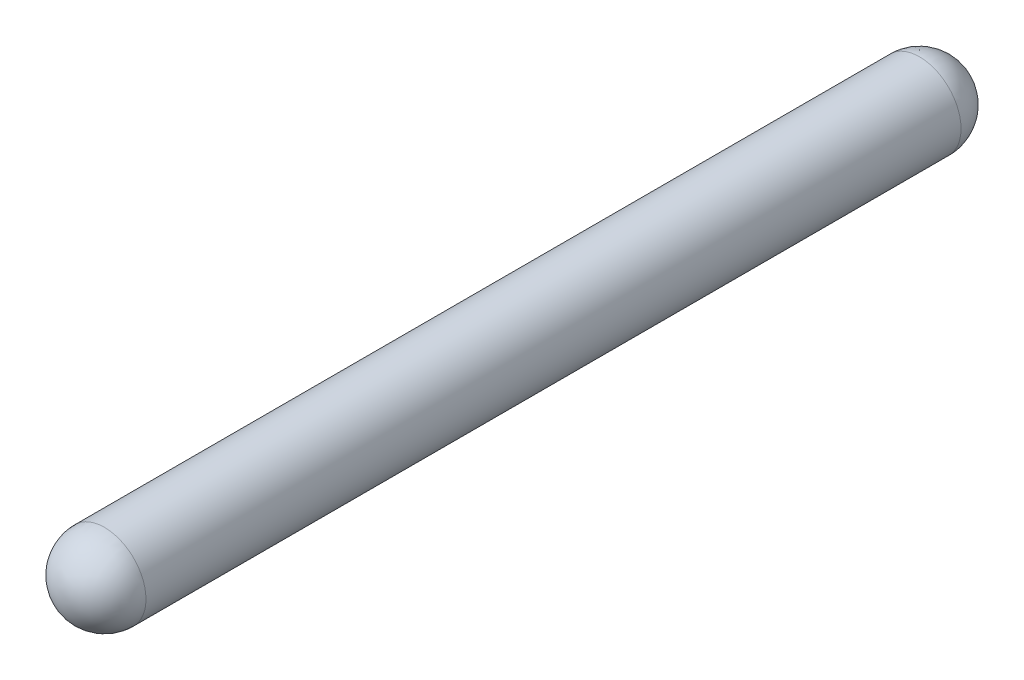
ISO-10303-21;
HEADER;
FILE_DESCRIPTION(('STEP AP214'),'2;1');
FILE_NAME('part.step','',(''),(''),'','','');
FILE_SCHEMA(('AUTOMOTIVE_DESIGN { 1 0 10303 214 1 1 1 1 }'));
ENDSEC;
DATA;
#1=APPLICATION_CONTEXT('core data for automotive mechanical design processes');
#2=APPLICATION_PROTOCOL_DEFINITION('international standard','automotive_design',2000,#1);
#3=PRODUCT_CONTEXT('',#1,'mechanical');
#4=PRODUCT('Part','Part','',(#3));
#5=PRODUCT_RELATED_PRODUCT_CATEGORY('part','',(#4));
#6=PRODUCT_DEFINITION_FORMATION('','',#4);
#7=PRODUCT_DEFINITION_CONTEXT('part definition',#1,'design');
#8=PRODUCT_DEFINITION('design','',#6,#7);
#9=PRODUCT_DEFINITION_SHAPE('','',#8);
#10=(LENGTH_UNIT() NAMED_UNIT(*) SI_UNIT(.MILLI.,.METRE.));
#11=(NAMED_UNIT(*) PLANE_ANGLE_UNIT() SI_UNIT($,.RADIAN.));
#12=(NAMED_UNIT(*) SI_UNIT($,.STERADIAN.) SOLID_ANGLE_UNIT());
#13=UNCERTAINTY_MEASURE_WITH_UNIT(LENGTH_MEASURE(1.E-05),#10,'distance_accuracy_value','');
#14=(GEOMETRIC_REPRESENTATION_CONTEXT(3) GLOBAL_UNCERTAINTY_ASSIGNED_CONTEXT((#13)) GLOBAL_UNIT_ASSIGNED_CONTEXT((#10,
#11,#12)) REPRESENTATION_CONTEXT('',''));
#15=CARTESIAN_POINT('',(0.,0.,0.));
#16=DIRECTION('',(0.,0.,1.));
#17=DIRECTION('',(1.,0.,0.));
#18=AXIS2_PLACEMENT_3D('',#15,#16,#17);
#19=CARTESIAN_POINT('',(0.,0.,-3.));
#20=DIRECTION('',(1.,0.,0.));
#21=DIRECTION('',(0.,-1.,0.));
#22=AXIS2_PLACEMENT_3D('',#19,#20,#21);
#23=SPHERICAL_SURFACE('',#22,0.331);
#24=CARTESIAN_POINT('',(0.,0.,-3.));
#25=DIRECTION('',(0.,0.,1.));
#26=DIRECTION('',(1.,0.,0.));
#27=AXIS2_PLACEMENT_3D('',#24,#25,#26);
#28=CIRCLE('',#27,0.331);
#29=CARTESIAN_POINT('',(0.331,0.,-3.));
#30=VERTEX_POINT('',#29);
#31=CARTESIAN_POINT('',(-0.331,0.,-3.));
#32=VERTEX_POINT('',#31);
#33=EDGE_CURVE('E42',#30,#32,#28,.T.);
#34=ORIENTED_EDGE('',*,*,#33,.F.);
#35=CARTESIAN_POINT('',(0.,0.,-3.));
#36=DIRECTION('',(0.,0.,1.));
#37=DIRECTION('',(1.,0.,0.));
#38=AXIS2_PLACEMENT_3D('',#35,#36,#37);
#39=CIRCLE('',#38,0.331);
#40=EDGE_CURVE('E26',#32,#30,#39,.T.);
#41=ORIENTED_EDGE('',*,*,#40,.F.);
#42=EDGE_LOOP('',(#34,#41));
#43=FACE_BOUND('',#42,.T.);
#44=ADVANCED_FACE('F17',(#43),#23,.T.);
#45=CARTESIAN_POINT('',(0.,0.,3.5));
#46=DIRECTION('',(1.,0.,0.));
#47=DIRECTION('',(0.,1.,0.));
#48=AXIS2_PLACEMENT_3D('',#45,#46,#47);
#49=SPHERICAL_SURFACE('',#48,0.331);
#50=CARTESIAN_POINT('',(0.,0.,3.5));
#51=DIRECTION('',(0.,0.,1.));
#52=DIRECTION('',(1.,0.,0.));
#53=AXIS2_PLACEMENT_3D('',#50,#51,#52);
#54=CIRCLE('',#53,0.331);
#55=CARTESIAN_POINT('',(0.331,0.,3.5));
#56=VERTEX_POINT('',#55);
#57=CARTESIAN_POINT('',(-0.331,0.,3.5));
#58=VERTEX_POINT('',#57);
#59=EDGE_CURVE('E11',#56,#58,#54,.F.);
#60=ORIENTED_EDGE('',*,*,#59,.F.);
#61=CARTESIAN_POINT('',(0.,0.,3.5));
#62=DIRECTION('',(0.,0.,1.));
#63=DIRECTION('',(1.,0.,0.));
#64=AXIS2_PLACEMENT_3D('',#61,#62,#63);
#65=CIRCLE('',#64,0.331);
#66=EDGE_CURVE('E34',#58,#56,#65,.F.);
#67=ORIENTED_EDGE('',*,*,#66,.F.);
#68=EDGE_LOOP('',(#60,#67));
#69=FACE_BOUND('',#68,.T.);
#70=ADVANCED_FACE('F49',(#69),#49,.T.);
#71=CARTESIAN_POINT('',(0.,0.,-3.));
#72=DIRECTION('',(0.,0.,1.));
#73=DIRECTION('',(1.,0.,0.));
#74=AXIS2_PLACEMENT_3D('',#71,#72,#73);
#75=CYLINDRICAL_SURFACE('',#74,0.331);
#76=ORIENTED_EDGE('',*,*,#66,.T.);
#77=ORIENTED_EDGE('',*,*,#59,.T.);
#78=EDGE_LOOP('',(#76,#77));
#79=FACE_BOUND('',#78,.T.);
#80=ORIENTED_EDGE('',*,*,#40,.T.);
#81=ORIENTED_EDGE('',*,*,#33,.T.);
#82=EDGE_LOOP('',(#80,#81));
#83=FACE_BOUND('',#82,.T.);
#84=ADVANCED_FACE('F45',(#79,#83),#75,.T.);
#85=CLOSED_SHELL('',(#44,#70,#84));
#86=MANIFOLD_SOLID_BREP('B1',#85);
#87=ADVANCED_BREP_SHAPE_REPRESENTATION('',(#18,#86),#14);
#88=SHAPE_DEFINITION_REPRESENTATION(#9,#87);
ENDSEC;
END-ISO-10303-21;
